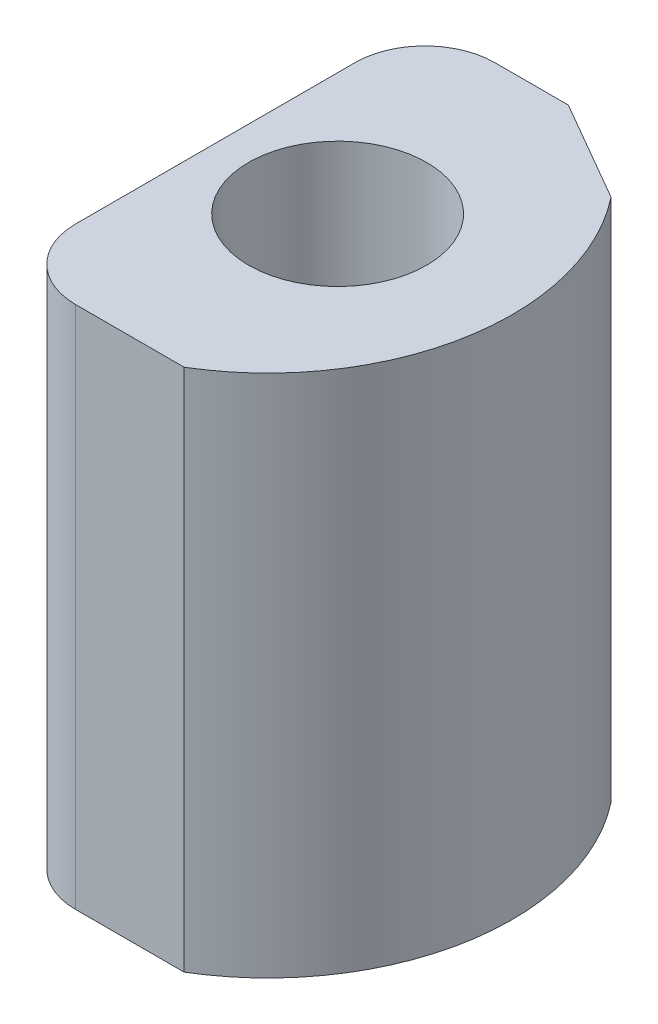
ISO-10303-21;
HEADER;
FILE_DESCRIPTION(('STEP AP214'),'2;1');
FILE_NAME('part.step','',(''),(''),'','','');
FILE_SCHEMA(('AUTOMOTIVE_DESIGN { 1 0 10303 214 1 1 1 1 }'));
ENDSEC;
DATA;
#1=APPLICATION_CONTEXT('core data for automotive mechanical design processes');
#2=APPLICATION_PROTOCOL_DEFINITION('international standard','automotive_design',2000,#1);
#3=PRODUCT_CONTEXT('',#1,'mechanical');
#4=PRODUCT('Part','Part','',(#3));
#5=PRODUCT_RELATED_PRODUCT_CATEGORY('part','',(#4));
#6=PRODUCT_DEFINITION_FORMATION('','',#4);
#7=PRODUCT_DEFINITION_CONTEXT('part definition',#1,'design');
#8=PRODUCT_DEFINITION('design','',#6,#7);
#9=PRODUCT_DEFINITION_SHAPE('','',#8);
#10=(LENGTH_UNIT() NAMED_UNIT(*) SI_UNIT(.MILLI.,.METRE.));
#11=(NAMED_UNIT(*) PLANE_ANGLE_UNIT() SI_UNIT($,.RADIAN.));
#12=(NAMED_UNIT(*) SI_UNIT($,.STERADIAN.) SOLID_ANGLE_UNIT());
#13=UNCERTAINTY_MEASURE_WITH_UNIT(LENGTH_MEASURE(1.E-05),#10,'distance_accuracy_value','');
#14=(GEOMETRIC_REPRESENTATION_CONTEXT(3) GLOBAL_UNCERTAINTY_ASSIGNED_CONTEXT((#13)) GLOBAL_UNIT_ASSIGNED_CONTEXT((#10,
#11,#12)) REPRESENTATION_CONTEXT('',''));
#15=CARTESIAN_POINT('',(0.,0.,0.));
#16=DIRECTION('',(0.,0.,1.));
#17=DIRECTION('',(1.,0.,0.));
#18=AXIS2_PLACEMENT_3D('',#15,#16,#17);
#19=CARTESIAN_POINT('',(-4.,30.,0.));
#20=DIRECTION('',(0.,-1.,0.));
#21=DIRECTION('',(0.,0.,-1.));
#22=AXIS2_PLACEMENT_3D('',#19,#20,#21);
#23=PLANE('',#22);
#24=CARTESIAN_POINT('',(-4.,30.,0.));
#25=DIRECTION('',(0.,1.,0.));
#26=DIRECTION('',(0.,0.,-1.));
#27=AXIS2_PLACEMENT_3D('',#24,#25,#26);
#28=CIRCLE('',#27,14.);
#29=CARTESIAN_POINT('',(3.21110255092798,30.,12.));
#30=VERTEX_POINT('',#29);
#31=CARTESIAN_POINT('',(7.00357035430948,30.,-8.65571715444547));
#32=VERTEX_POINT('',#31);
#33=EDGE_CURVE('E98',#30,#32,#28,.T.);
#34=ORIENTED_EDGE('',*,*,#33,.T.);
#35=DIRECTION('',(0.86602540378444,0.,0.499999999999998));
#36=VECTOR('',#35,1.);
#37=CARTESIAN_POINT('',(1.21110255092797,30.,-12.));
#38=LINE('',#37,#36);
#39=CARTESIAN_POINT('',(1.21110255092797,30.,-12.));
#40=VERTEX_POINT('',#39);
#41=EDGE_CURVE('E11',#32,#40,#38,.F.);
#42=ORIENTED_EDGE('',*,*,#41,.T.);
#43=DIRECTION('',(-1.,0.,0.));
#44=VECTOR('',#43,1.);
#45=CARTESIAN_POINT('',(3.21110255092798,30.,-12.));
#46=LINE('',#45,#44);
#47=CARTESIAN_POINT('',(-3.,30.,-12.));
#48=VERTEX_POINT('',#47);
#49=EDGE_CURVE('E116',#40,#48,#46,.T.);
#50=ORIENTED_EDGE('',*,*,#49,.T.);
#51=CARTESIAN_POINT('',(-3.,30.,-8.));
#52=DIRECTION('',(0.,-1.,0.));
#53=DIRECTION('',(0.,0.,-1.));
#54=AXIS2_PLACEMENT_3D('',#51,#52,#53);
#55=CIRCLE('',#54,4.);
#56=CARTESIAN_POINT('',(-7.,30.,-8.));
#57=VERTEX_POINT('',#56);
#58=EDGE_CURVE('E146',#48,#57,#55,.F.);
#59=ORIENTED_EDGE('',*,*,#58,.T.);
#60=DIRECTION('',(0.,0.,1.));
#61=VECTOR('',#60,1.);
#62=CARTESIAN_POINT('',(-7.,30.,-12.));
#63=LINE('',#62,#61);
#64=CARTESIAN_POINT('',(-7.,30.,8.));
#65=VERTEX_POINT('',#64);
#66=EDGE_CURVE('E107',#57,#65,#63,.T.);
#67=ORIENTED_EDGE('',*,*,#66,.T.);
#68=CARTESIAN_POINT('',(-3.,30.,8.));
#69=DIRECTION('',(0.,-1.,0.));
#70=DIRECTION('',(0.,0.,-1.));
#71=AXIS2_PLACEMENT_3D('',#68,#69,#70);
#72=CIRCLE('',#71,4.);
#73=CARTESIAN_POINT('',(-3.,30.,12.));
#74=VERTEX_POINT('',#73);
#75=EDGE_CURVE('E102',#65,#74,#72,.F.);
#76=ORIENTED_EDGE('',*,*,#75,.T.);
#77=DIRECTION('',(1.,0.,0.));
#78=VECTOR('',#77,1.);
#79=CARTESIAN_POINT('',(-7.,30.,12.));
#80=LINE('',#79,#78);
#81=EDGE_CURVE('E95',#74,#30,#80,.T.);
#82=ORIENTED_EDGE('',*,*,#81,.T.);
#83=EDGE_LOOP('',(#34,#42,#50,#59,#67,#76,#82));
#84=FACE_BOUND('',#83,.T.);
#85=CARTESIAN_POINT('',(0.,30.,0.));
#86=DIRECTION('',(0.,1.,0.));
#87=DIRECTION('',(0.,0.,1.));
#88=AXIS2_PLACEMENT_3D('',#85,#86,#87);
#89=CIRCLE('',#88,5.1);
#90=CARTESIAN_POINT('',(0.,30.,5.1));
#91=VERTEX_POINT('',#90);
#92=EDGE_CURVE('E129',#91,#91,#89,.T.);
#93=ORIENTED_EDGE('',*,*,#92,.F.);
#94=EDGE_LOOP('',(#93));
#95=FACE_BOUND('',#94,.T.);
#96=ADVANCED_FACE('F36',(#84,#95),#23,.F.);
#97=CARTESIAN_POINT('',(-4.,0.,0.));
#98=DIRECTION('',(0.,-1.,0.));
#99=DIRECTION('',(0.,0.,-1.));
#100=AXIS2_PLACEMENT_3D('',#97,#98,#99);
#101=PLANE('',#100);
#102=DIRECTION('',(-1.,0.,0.));
#103=VECTOR('',#102,1.);
#104=CARTESIAN_POINT('',(3.21110255092798,0.,-12.));
#105=LINE('',#104,#103);
#106=CARTESIAN_POINT('',(1.21110255092797,0.,-12.));
#107=VERTEX_POINT('',#106);
#108=CARTESIAN_POINT('',(-3.,0.,-12.));
#109=VERTEX_POINT('',#108);
#110=EDGE_CURVE('E128',#107,#109,#105,.T.);
#111=ORIENTED_EDGE('',*,*,#110,.F.);
#112=DIRECTION('',(-0.86602540378444,0.,-0.499999999999998));
#113=VECTOR('',#112,1.);
#114=CARTESIAN_POINT('',(2.4989280604386,0.,-11.2564735954148));
#115=LINE('',#114,#113);
#116=CARTESIAN_POINT('',(7.00357035430948,0.,-8.65571715444547));
#117=VERTEX_POINT('',#116);
#118=EDGE_CURVE('E59',#107,#117,#115,.F.);
#119=ORIENTED_EDGE('',*,*,#118,.T.);
#120=CARTESIAN_POINT('',(-4.,0.,0.));
#121=DIRECTION('',(0.,1.,0.));
#122=DIRECTION('',(0.,0.,-1.));
#123=AXIS2_PLACEMENT_3D('',#120,#121,#122);
#124=CIRCLE('',#123,14.);
#125=CARTESIAN_POINT('',(3.21110255092798,0.,12.));
#126=VERTEX_POINT('',#125);
#127=EDGE_CURVE('E126',#126,#117,#124,.T.);
#128=ORIENTED_EDGE('',*,*,#127,.F.);
#129=DIRECTION('',(1.,0.,0.));
#130=VECTOR('',#129,1.);
#131=CARTESIAN_POINT('',(-7.,0.,12.));
#132=LINE('',#131,#130);
#133=CARTESIAN_POINT('',(-3.,0.,12.));
#134=VERTEX_POINT('',#133);
#135=EDGE_CURVE('E112',#134,#126,#132,.T.);
#136=ORIENTED_EDGE('',*,*,#135,.F.);
#137=CARTESIAN_POINT('',(-3.,0.,8.));
#138=DIRECTION('',(0.,-1.,0.));
#139=DIRECTION('',(0.,0.,-1.));
#140=AXIS2_PLACEMENT_3D('',#137,#138,#139);
#141=CIRCLE('',#140,4.);
#142=CARTESIAN_POINT('',(-7.,0.,8.));
#143=VERTEX_POINT('',#142);
#144=EDGE_CURVE('E137',#134,#143,#141,.T.);
#145=ORIENTED_EDGE('',*,*,#144,.T.);
#146=DIRECTION('',(0.,0.,1.));
#147=VECTOR('',#146,1.);
#148=CARTESIAN_POINT('',(-7.,0.,-12.));
#149=LINE('',#148,#147);
#150=CARTESIAN_POINT('',(-7.,0.,-8.));
#151=VERTEX_POINT('',#150);
#152=EDGE_CURVE('E119',#151,#143,#149,.T.);
#153=ORIENTED_EDGE('',*,*,#152,.F.);
#154=CARTESIAN_POINT('',(-3.,0.,-8.));
#155=DIRECTION('',(0.,-1.,0.));
#156=DIRECTION('',(0.,0.,-1.));
#157=AXIS2_PLACEMENT_3D('',#154,#155,#156);
#158=CIRCLE('',#157,4.);
#159=EDGE_CURVE('E139',#151,#109,#158,.T.);
#160=ORIENTED_EDGE('',*,*,#159,.T.);
#161=EDGE_LOOP('',(#111,#119,#128,#136,#145,#153,#160));
#162=FACE_BOUND('',#161,.T.);
#163=CARTESIAN_POINT('',(0.,0.,0.));
#164=DIRECTION('',(0.,1.,0.));
#165=DIRECTION('',(0.,0.,1.));
#166=AXIS2_PLACEMENT_3D('',#163,#164,#165);
#167=CIRCLE('',#166,5.1);
#168=CARTESIAN_POINT('',(0.,0.,5.1));
#169=VERTEX_POINT('',#168);
#170=EDGE_CURVE('E122',#169,#169,#167,.T.);
#171=ORIENTED_EDGE('',*,*,#170,.T.);
#172=EDGE_LOOP('',(#171));
#173=FACE_BOUND('',#172,.T.);
#174=ADVANCED_FACE('F158',(#162,#173),#101,.T.);
#175=CARTESIAN_POINT('',(-4.,30.,0.));
#176=DIRECTION('',(0.,-1.,0.));
#177=DIRECTION('',(0.,0.,-1.));
#178=AXIS2_PLACEMENT_3D('',#175,#176,#177);
#179=CYLINDRICAL_SURFACE('',#178,14.);
#180=ORIENTED_EDGE('',*,*,#127,.T.);
#181=DIRECTION('',(0.,-1.,0.));
#182=VECTOR('',#181,1.);
#183=CARTESIAN_POINT('',(7.00357035430949,30.,-8.65571715444547));
#184=LINE('',#183,#182);
#185=EDGE_CURVE('E45',#117,#32,#184,.F.);
#186=ORIENTED_EDGE('',*,*,#185,.T.);
#187=ORIENTED_EDGE('',*,*,#33,.F.);
#188=DIRECTION('',(0.,-1.,0.));
#189=VECTOR('',#188,1.);
#190=CARTESIAN_POINT('',(3.21110255092798,30.,12.));
#191=LINE('',#190,#189);
#192=EDGE_CURVE('E106',#30,#126,#191,.T.);
#193=ORIENTED_EDGE('',*,*,#192,.T.);
#194=EDGE_LOOP('',(#180,#186,#187,#193));
#195=FACE_BOUND('',#194,.T.);
#196=ADVANCED_FACE('F115',(#195),#179,.T.);
#197=CARTESIAN_POINT('',(3.21110255092798,30.,-12.));
#198=DIRECTION('',(0.,0.,1.));
#199=DIRECTION('',(1.,0.,0.));
#200=AXIS2_PLACEMENT_3D('',#197,#198,#199);
#201=PLANE('',#200);
#202=ORIENTED_EDGE('',*,*,#49,.F.);
#203=DIRECTION('',(0.,-1.,0.));
#204=VECTOR('',#203,1.);
#205=CARTESIAN_POINT('',(1.21110255092797,30.,-12.));
#206=LINE('',#205,#204);
#207=EDGE_CURVE('E150',#40,#107,#206,.T.);
#208=ORIENTED_EDGE('',*,*,#207,.T.);
#209=ORIENTED_EDGE('',*,*,#110,.T.);
#210=DIRECTION('',(0.,-1.,0.));
#211=VECTOR('',#210,1.);
#212=CARTESIAN_POINT('',(-3.,30.,-12.));
#213=LINE('',#212,#211);
#214=EDGE_CURVE('E142',#109,#48,#213,.F.);
#215=ORIENTED_EDGE('',*,*,#214,.T.);
#216=EDGE_LOOP('',(#202,#208,#209,#215));
#217=FACE_BOUND('',#216,.T.);
#218=ADVANCED_FACE('F156',(#217),#201,.F.);
#219=CARTESIAN_POINT('',(-7.,30.,-12.));
#220=DIRECTION('',(1.,0.,0.));
#221=DIRECTION('',(0.,0.,-1.));
#222=AXIS2_PLACEMENT_3D('',#219,#220,#221);
#223=PLANE('',#222);
#224=ORIENTED_EDGE('',*,*,#66,.F.);
#225=DIRECTION('',(0.,-1.,0.));
#226=VECTOR('',#225,1.);
#227=CARTESIAN_POINT('',(-7.,30.,-8.));
#228=LINE('',#227,#226);
#229=EDGE_CURVE('E134',#57,#151,#228,.T.);
#230=ORIENTED_EDGE('',*,*,#229,.T.);
#231=ORIENTED_EDGE('',*,*,#152,.T.);
#232=DIRECTION('',(0.,-1.,0.));
#233=VECTOR('',#232,1.);
#234=CARTESIAN_POINT('',(-7.,30.,8.));
#235=LINE('',#234,#233);
#236=EDGE_CURVE('E113',#143,#65,#235,.F.);
#237=ORIENTED_EDGE('',*,*,#236,.T.);
#238=EDGE_LOOP('',(#224,#230,#231,#237));
#239=FACE_BOUND('',#238,.T.);
#240=ADVANCED_FACE('F168',(#239),#223,.F.);
#241=CARTESIAN_POINT('',(-7.,30.,12.));
#242=DIRECTION('',(0.,0.,-1.));
#243=DIRECTION('',(-1.,0.,0.));
#244=AXIS2_PLACEMENT_3D('',#241,#242,#243);
#245=PLANE('',#244);
#246=ORIENTED_EDGE('',*,*,#81,.F.);
#247=DIRECTION('',(0.,-1.,0.));
#248=VECTOR('',#247,1.);
#249=CARTESIAN_POINT('',(-3.,30.,12.));
#250=LINE('',#249,#248);
#251=EDGE_CURVE('E148',#74,#134,#250,.T.);
#252=ORIENTED_EDGE('',*,*,#251,.T.);
#253=ORIENTED_EDGE('',*,*,#135,.T.);
#254=ORIENTED_EDGE('',*,*,#192,.F.);
#255=EDGE_LOOP('',(#246,#252,#253,#254));
#256=FACE_BOUND('',#255,.T.);
#257=ADVANCED_FACE('F110',(#256),#245,.F.);
#258=CARTESIAN_POINT('',(0.,30.,0.));
#259=DIRECTION('',(0.,-1.,0.));
#260=DIRECTION('',(0.,0.,-1.));
#261=AXIS2_PLACEMENT_3D('',#258,#259,#260);
#262=CYLINDRICAL_SURFACE('',#261,5.1);
#263=ORIENTED_EDGE('',*,*,#92,.T.);
#264=EDGE_LOOP('',(#263));
#265=FACE_BOUND('',#264,.T.);
#266=ORIENTED_EDGE('',*,*,#170,.F.);
#267=EDGE_LOOP('',(#266));
#268=FACE_BOUND('',#267,.T.);
#269=ADVANCED_FACE('F183',(#265,#268),#262,.F.);
#270=CARTESIAN_POINT('',(-3.,30.,-8.));
#271=DIRECTION('',(0.,-1.,0.));
#272=DIRECTION('',(0.,0.,-1.));
#273=AXIS2_PLACEMENT_3D('',#270,#271,#272);
#274=CYLINDRICAL_SURFACE('',#273,4.);
#275=ORIENTED_EDGE('',*,*,#58,.F.);
#276=ORIENTED_EDGE('',*,*,#214,.F.);
#277=ORIENTED_EDGE('',*,*,#159,.F.);
#278=ORIENTED_EDGE('',*,*,#229,.F.);
#279=EDGE_LOOP('',(#275,#276,#277,#278));
#280=FACE_BOUND('',#279,.T.);
#281=ADVANCED_FACE('F165',(#280),#274,.T.);
#282=CARTESIAN_POINT('',(-3.,30.,8.));
#283=DIRECTION('',(0.,-1.,0.));
#284=DIRECTION('',(0.,0.,-1.));
#285=AXIS2_PLACEMENT_3D('',#282,#283,#284);
#286=CYLINDRICAL_SURFACE('',#285,4.);
#287=ORIENTED_EDGE('',*,*,#75,.F.);
#288=ORIENTED_EDGE('',*,*,#236,.F.);
#289=ORIENTED_EDGE('',*,*,#144,.F.);
#290=ORIENTED_EDGE('',*,*,#251,.F.);
#291=EDGE_LOOP('',(#287,#288,#289,#290));
#292=FACE_BOUND('',#291,.T.);
#293=ADVANCED_FACE('F171',(#292),#286,.T.);
#294=CARTESIAN_POINT('',(1.21110255092797,30.,-12.));
#295=DIRECTION('',(-0.499999999999998,0.,0.86602540378444));
#296=DIRECTION('',(0.,-1.,0.));
#297=AXIS2_PLACEMENT_3D('',#294,#295,#296);
#298=PLANE('',#297);
#299=ORIENTED_EDGE('',*,*,#41,.F.);
#300=ORIENTED_EDGE('',*,*,#185,.F.);
#301=ORIENTED_EDGE('',*,*,#118,.F.);
#302=ORIENTED_EDGE('',*,*,#207,.F.);
#303=EDGE_LOOP('',(#299,#300,#301,#302));
#304=FACE_BOUND('',#303,.T.);
#305=ADVANCED_FACE('F39',(#304),#298,.F.);
#306=CLOSED_SHELL('',(#96,#174,#196,#218,#240,#257,#269,#281,#293,#305));
#307=MANIFOLD_SOLID_BREP('B2',#306);
#308=ADVANCED_BREP_SHAPE_REPRESENTATION('',(#18,#307),#14);
#309=SHAPE_DEFINITION_REPRESENTATION(#9,#308);
ENDSEC;
END-ISO-10303-21;
